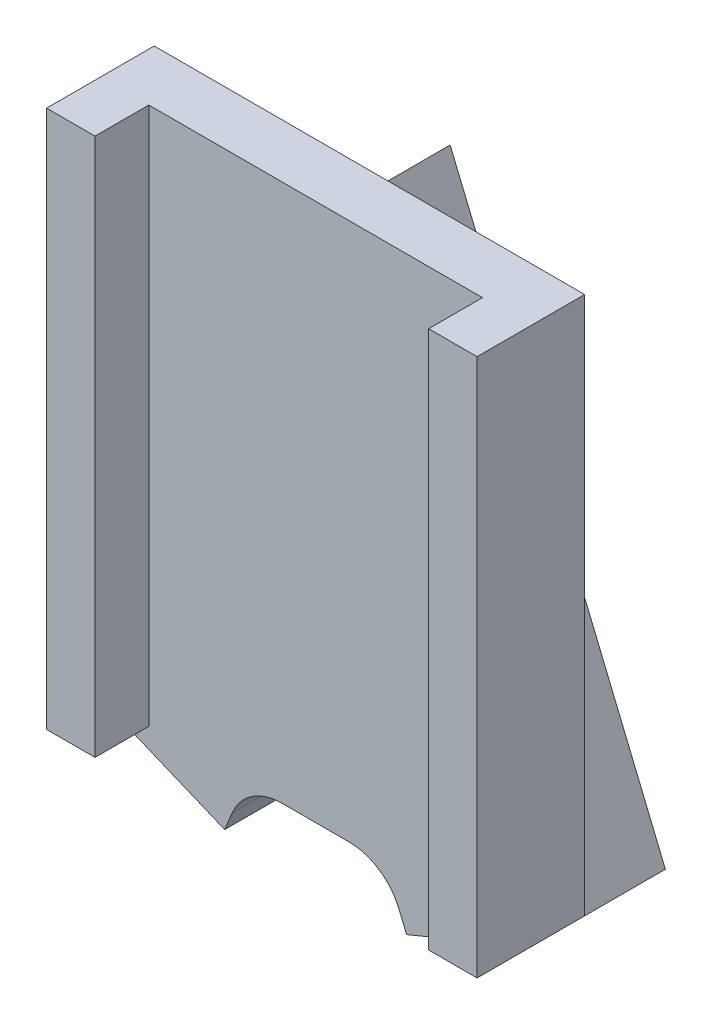
ISO-10303-21;
HEADER;
FILE_DESCRIPTION(('STEP AP214'),'2;1');
FILE_NAME('part.step','',(''),(''),'','','');
FILE_SCHEMA(('AUTOMOTIVE_DESIGN { 1 0 10303 214 1 1 1 1 }'));
ENDSEC;
DATA;
#1=APPLICATION_CONTEXT('core data for automotive mechanical design processes');
#2=APPLICATION_PROTOCOL_DEFINITION('international standard','automotive_design',2000,#1);
#3=PRODUCT_CONTEXT('',#1,'mechanical');
#4=PRODUCT('Part','Part','',(#3));
#5=PRODUCT_RELATED_PRODUCT_CATEGORY('part','',(#4));
#6=PRODUCT_DEFINITION_FORMATION('','',#4);
#7=PRODUCT_DEFINITION_CONTEXT('part definition',#1,'design');
#8=PRODUCT_DEFINITION('design','',#6,#7);
#9=PRODUCT_DEFINITION_SHAPE('','',#8);
#10=(LENGTH_UNIT() NAMED_UNIT(*) SI_UNIT(.MILLI.,.METRE.));
#11=(NAMED_UNIT(*) PLANE_ANGLE_UNIT() SI_UNIT($,.RADIAN.));
#12=(NAMED_UNIT(*) SI_UNIT($,.STERADIAN.) SOLID_ANGLE_UNIT());
#13=UNCERTAINTY_MEASURE_WITH_UNIT(LENGTH_MEASURE(1.E-05),#10,'distance_accuracy_value','');
#14=(GEOMETRIC_REPRESENTATION_CONTEXT(3) GLOBAL_UNCERTAINTY_ASSIGNED_CONTEXT((#13)) GLOBAL_UNIT_ASSIGNED_CONTEXT((#10,
#11,#12)) REPRESENTATION_CONTEXT('',''));
#15=CARTESIAN_POINT('',(0.,0.,0.));
#16=DIRECTION('',(0.,0.,1.));
#17=DIRECTION('',(1.,0.,0.));
#18=AXIS2_PLACEMENT_3D('',#15,#16,#17);
#19=CARTESIAN_POINT('',(2.30969883127822,-10.9567085809127,1.));
#20=DIRECTION('',(0.923879532511288,-0.382683432365087,0.));
#21=DIRECTION('',(0.382683432365087,0.923879532511288,0.));
#22=AXIS2_PLACEMENT_3D('',#19,#20,#21);
#23=PLANE('',#22);
#24=DIRECTION('',(0.382683432365087,0.923879532511288,0.));
#25=VECTOR('',#24,1.);
#26=CARTESIAN_POINT('',(5.84523273721094,-2.42117467497996,0.));
#27=LINE('',#26,#25);
#28=CARTESIAN_POINT('',(2.450279606139,-10.6173165676349,0.));
#29=VERTEX_POINT('',#28);
#30=CARTESIAN_POINT('',(3.71016818448233,-7.57567647471944,0.));
#31=VERTEX_POINT('',#30);
#32=EDGE_CURVE('E207',#29,#31,#27,.T.);
#33=ORIENTED_EDGE('',*,*,#32,.F.);
#34=DIRECTION('',(0.,0.,-1.));
#35=VECTOR('',#34,1.);
#36=CARTESIAN_POINT('',(2.450279606139,-10.6173165676349,1.));
#37=LINE('',#36,#35);
#38=CARTESIAN_POINT('',(2.450279606139,-10.6173165676349,1.));
#39=VERTEX_POINT('',#38);
#40=EDGE_CURVE('E296',#29,#39,#37,.F.);
#41=ORIENTED_EDGE('',*,*,#40,.T.);
#42=DIRECTION('',(-0.382683432365087,-0.923879532511288,0.));
#43=VECTOR('',#42,1.);
#44=CARTESIAN_POINT('',(2.30969883127822,-10.9567085809127,1.));
#45=LINE('',#44,#43);
#46=CARTESIAN_POINT('',(2.30969883127822,-10.9567085809127,1.));
#47=VERTEX_POINT('',#46);
#48=EDGE_CURVE('E308',#39,#47,#45,.T.);
#49=ORIENTED_EDGE('',*,*,#48,.T.);
#50=DIRECTION('',(0.,0.,-1.));
#51=VECTOR('',#50,1.);
#52=CARTESIAN_POINT('',(2.30969883127822,-10.9567085809127,1.));
#53=LINE('',#52,#51);
#54=CARTESIAN_POINT('',(2.30969883127822,-10.9567085809127,-1.5));
#55=VERTEX_POINT('',#54);
#56=EDGE_CURVE('E348',#47,#55,#53,.T.);
#57=ORIENTED_EDGE('',*,*,#56,.T.);
#58=DIRECTION('',(-0.382683432365087,-0.923879532511288,0.));
#59=VECTOR('',#58,1.);
#60=CARTESIAN_POINT('',(2.30969883127822,-10.9567085809127,-1.5));
#61=LINE('',#60,#59);
#62=CARTESIAN_POINT('',(3.71016818448233,-7.57567647471944,-1.5));
#63=VERTEX_POINT('',#62);
#64=EDGE_CURVE('E361',#63,#55,#61,.T.);
#65=ORIENTED_EDGE('',*,*,#64,.F.);
#66=DIRECTION('',(0.,0.,-1.));
#67=VECTOR('',#66,1.);
#68=CARTESIAN_POINT('',(3.71016818448233,-7.57567647471944,0.));
#69=LINE('',#68,#67);
#70=EDGE_CURVE('E198',#31,#63,#69,.T.);
#71=ORIENTED_EDGE('',*,*,#70,.F.);
#72=EDGE_LOOP('',(#33,#41,#49,#57,#65,#71));
#73=FACE_BOUND('',#72,.T.);
#74=ADVANCED_FACE('F33',(#73),#23,.T.);
#75=CARTESIAN_POINT('',(3.99999999999999,-6.8759605748895,1.));
#76=DIRECTION('',(-0.923879532511288,-0.382683432365088,0.));
#77=DIRECTION('',(0.382683432365088,-0.923879532511288,0.));
#78=AXIS2_PLACEMENT_3D('',#75,#76,#77);
#79=PLANE('',#78);
#80=DIRECTION('',(0.,0.,-1.));
#81=VECTOR('',#80,1.);
#82=CARTESIAN_POINT('',(4.01000933746841,-6.90012525315614,0.));
#83=LINE('',#82,#81);
#84=CARTESIAN_POINT('',(4.01000933746841,-6.90012525315614,0.));
#85=VERTEX_POINT('',#84);
#86=CARTESIAN_POINT('',(4.01000933746841,-6.90012525315614,-1.5));
#87=VERTEX_POINT('',#86);
#88=EDGE_CURVE('E199',#85,#87,#83,.T.);
#89=ORIENTED_EDGE('',*,*,#88,.F.);
#90=DIRECTION('',(0.382683432365088,-0.923879532511288,0.));
#91=VECTOR('',#90,1.);
#92=CARTESIAN_POINT('',(0.983194387535245,0.407252449766205,0.));
#93=LINE('',#92,#91);
#94=CARTESIAN_POINT('',(3.99999999999999,-6.8759605748895,0.));
#95=VERTEX_POINT('',#94);
#96=EDGE_CURVE('E214',#95,#85,#93,.T.);
#97=ORIENTED_EDGE('',*,*,#96,.F.);
#98=DIRECTION('',(0.,0.,-1.));
#99=VECTOR('',#98,1.);
#100=CARTESIAN_POINT('',(3.99999999999999,-6.8759605748895,1.));
#101=LINE('',#100,#99);
#102=CARTESIAN_POINT('',(3.99999999999999,-6.8759605748895,-1.5));
#103=VERTEX_POINT('',#102);
#104=EDGE_CURVE('E213',#95,#103,#101,.T.);
#105=ORIENTED_EDGE('',*,*,#104,.T.);
#106=DIRECTION('',(-0.382683432365088,0.923879532511288,0.));
#107=VECTOR('',#106,1.);
#108=CARTESIAN_POINT('',(3.99999999999999,-6.8759605748895,-1.5));
#109=LINE('',#108,#107);
#110=EDGE_CURVE('E362',#87,#103,#109,.T.);
#111=ORIENTED_EDGE('',*,*,#110,.F.);
#112=EDGE_LOOP('',(#89,#97,#105,#111));
#113=FACE_BOUND('',#112,.T.);
#114=ADVANCED_FACE('F437',(#113),#79,.T.);
#115=CARTESIAN_POINT('',(0.,-10.,2.));
#116=DIRECTION('',(0.,1.,0.));
#117=DIRECTION('',(0.,0.,1.));
#118=AXIS2_PLACEMENT_3D('',#115,#116,#117);
#119=PLANE('',#118);
#120=DIRECTION('',(1.,0.,0.));
#121=VECTOR('',#120,1.);
#122=CARTESIAN_POINT('',(0.900000000000001,-10.,1.));
#123=LINE('',#122,#121);
#124=CARTESIAN_POINT('',(3.37415913865028,-10.,1.));
#125=VERTEX_POINT('',#124);
#126=CARTESIAN_POINT('',(4.6258408613497,-10.,1.));
#127=VERTEX_POINT('',#126);
#128=EDGE_CURVE('E231',#125,#127,#123,.T.);
#129=ORIENTED_EDGE('',*,*,#128,.F.);
#130=DIRECTION('',(0.,0.,-1.));
#131=VECTOR('',#130,1.);
#132=CARTESIAN_POINT('',(3.37415913865028,-10.,2.));
#133=LINE('',#132,#131);
#134=CARTESIAN_POINT('',(3.37415913865028,-10.,0.));
#135=VERTEX_POINT('',#134);
#136=EDGE_CURVE('E293',#125,#135,#133,.T.);
#137=ORIENTED_EDGE('',*,*,#136,.T.);
#138=DIRECTION('',(1.,0.,0.));
#139=VECTOR('',#138,1.);
#140=CARTESIAN_POINT('',(0.,-10.,0.));
#141=LINE('',#140,#139);
#142=CARTESIAN_POINT('',(4.6258408613497,-10.,0.));
#143=VERTEX_POINT('',#142);
#144=EDGE_CURVE('E270',#135,#143,#141,.T.);
#145=ORIENTED_EDGE('',*,*,#144,.T.);
#146=DIRECTION('',(0.,0.,1.));
#147=VECTOR('',#146,1.);
#148=CARTESIAN_POINT('',(4.6258408613497,-10.,2.));
#149=LINE('',#148,#147);
#150=EDGE_CURVE('E290',#143,#127,#149,.T.);
#151=ORIENTED_EDGE('',*,*,#150,.T.);
#152=EDGE_LOOP('',(#129,#137,#145,#151));
#153=FACE_BOUND('',#152,.T.);
#154=ADVANCED_FACE('F313',(#153),#119,.F.);
#155=DIRECTION('',(0.,0.,-1.));
#156=VECTOR('',#155,1.);
#157=CARTESIAN_POINT('',(0.,-10.,2.));
#158=LINE('',#157,#156);
#159=CARTESIAN_POINT('',(0.,-10.,2.));
#160=VERTEX_POINT('',#159);
#161=CARTESIAN_POINT('',(0.,-10.,1.));
#162=VERTEX_POINT('',#161);
#163=EDGE_CURVE('E284',#160,#162,#158,.T.);
#164=ORIENTED_EDGE('',*,*,#163,.T.);
#165=DIRECTION('',(1.,0.,0.));
#166=VECTOR('',#165,1.);
#167=CARTESIAN_POINT('',(0.,-10.,1.));
#168=LINE('',#167,#166);
#169=CARTESIAN_POINT('',(0.900000000000001,-10.,1.));
#170=VERTEX_POINT('',#169);
#171=EDGE_CURVE('E228',#162,#170,#168,.T.);
#172=ORIENTED_EDGE('',*,*,#171,.T.);
#173=DIRECTION('',(0.,0.,1.));
#174=VECTOR('',#173,1.);
#175=CARTESIAN_POINT('',(0.900000000000001,-10.,1.));
#176=LINE('',#175,#174);
#177=CARTESIAN_POINT('',(0.900000000000001,-10.,2.));
#178=VERTEX_POINT('',#177);
#179=EDGE_CURVE('E239',#170,#178,#176,.T.);
#180=ORIENTED_EDGE('',*,*,#179,.T.);
#181=DIRECTION('',(1.,0.,0.));
#182=VECTOR('',#181,1.);
#183=CARTESIAN_POINT('',(0.,-10.,2.));
#184=LINE('',#183,#182);
#185=EDGE_CURVE('E258',#160,#178,#184,.T.);
#186=ORIENTED_EDGE('',*,*,#185,.F.);
#187=EDGE_LOOP('',(#164,#172,#180,#186));
#188=FACE_BOUND('',#187,.T.);
#189=ADVANCED_FACE('F429',(#188),#119,.F.);
#190=CARTESIAN_POINT('',(0.,0.,0.));
#191=DIRECTION('',(0.,0.,1.));
#192=DIRECTION('',(1.,0.,0.));
#193=AXIS2_PLACEMENT_3D('',#190,#191,#192);
#194=PLANE('',#193);
#195=DIRECTION('',(0.,1.,0.));
#196=VECTOR('',#195,1.);
#197=CARTESIAN_POINT('',(7.99999999999998,0.,0.));
#198=LINE('',#197,#196);
#199=CARTESIAN_POINT('',(7.99999999999998,-10.,0.));
#200=VERTEX_POINT('',#199);
#201=CARTESIAN_POINT('',(7.99999999999998,0.,0.));
#202=VERTEX_POINT('',#201);
#203=EDGE_CURVE('E273',#200,#202,#198,.T.);
#204=ORIENTED_EDGE('',*,*,#203,.F.);
#205=DIRECTION('',(-0.382683432365088,0.923879532511288,0.));
#206=VECTOR('',#205,1.);
#207=CARTESIAN_POINT('',(3.29289321881346,1.36396103067892,0.));
#208=LINE('',#207,#206);
#209=CARTESIAN_POINT('',(3.99999999999999,-0.343145750507577,0.));
#210=VERTEX_POINT('',#209);
#211=EDGE_CURVE('E222',#200,#210,#208,.T.);
#212=ORIENTED_EDGE('',*,*,#211,.T.);
#213=DIRECTION('',(-0.382683432365087,-0.923879532511288,0.));
#214=VECTOR('',#213,1.);
#215=CARTESIAN_POINT('',(3.53553390593272,-1.46446609406724,0.));
#216=LINE('',#215,#214);
#217=CARTESIAN_POINT('',(0.,-10.,0.));
#218=VERTEX_POINT('',#217);
#219=EDGE_CURVE('E216',#210,#218,#216,.T.);
#220=ORIENTED_EDGE('',*,*,#219,.T.);
#221=DIRECTION('',(0.,-1.,0.));
#222=VECTOR('',#221,1.);
#223=CARTESIAN_POINT('',(0.,0.,0.));
#224=LINE('',#223,#222);
#225=CARTESIAN_POINT('',(0.,0.,0.));
#226=VERTEX_POINT('',#225);
#227=EDGE_CURVE('E245',#226,#218,#224,.T.);
#228=ORIENTED_EDGE('',*,*,#227,.F.);
#229=DIRECTION('',(-1.,0.,0.));
#230=VECTOR('',#229,1.);
#231=CARTESIAN_POINT('',(0.,0.,0.));
#232=LINE('',#231,#230);
#233=EDGE_CURVE('E257',#202,#226,#232,.T.);
#234=ORIENTED_EDGE('',*,*,#233,.F.);
#235=EDGE_LOOP('',(#204,#212,#220,#228,#234));
#236=FACE_BOUND('',#235,.T.);
#237=ADVANCED_FACE('F395',(#236),#194,.F.);
#238=CARTESIAN_POINT('',(0.,0.,2.));
#239=DIRECTION('',(0.,0.,1.));
#240=DIRECTION('',(1.,0.,0.));
#241=AXIS2_PLACEMENT_3D('',#238,#239,#240);
#242=PLANE('',#241);
#243=DIRECTION('',(0.,-1.,0.));
#244=VECTOR('',#243,1.);
#245=CARTESIAN_POINT('',(0.9,0.,2.));
#246=LINE('',#245,#244);
#247=CARTESIAN_POINT('',(0.9,0.,2.));
#248=VERTEX_POINT('',#247);
#249=EDGE_CURVE('E240',#248,#178,#246,.T.);
#250=ORIENTED_EDGE('',*,*,#249,.F.);
#251=DIRECTION('',(-1.,0.,0.));
#252=VECTOR('',#251,1.);
#253=CARTESIAN_POINT('',(0.,0.,2.));
#254=LINE('',#253,#252);
#255=CARTESIAN_POINT('',(0.,0.,2.));
#256=VERTEX_POINT('',#255);
#257=EDGE_CURVE('E263',#248,#256,#254,.T.);
#258=ORIENTED_EDGE('',*,*,#257,.T.);
#259=DIRECTION('',(0.,-1.,0.));
#260=VECTOR('',#259,1.);
#261=CARTESIAN_POINT('',(0.,0.,2.));
#262=LINE('',#261,#260);
#263=EDGE_CURVE('E253',#256,#160,#262,.T.);
#264=ORIENTED_EDGE('',*,*,#263,.T.);
#265=ORIENTED_EDGE('',*,*,#185,.T.);
#266=EDGE_LOOP('',(#250,#258,#264,#265));
#267=FACE_BOUND('',#266,.T.);
#268=ADVANCED_FACE('F409',(#267),#242,.T.);
#269=CARTESIAN_POINT('',(0.,0.,2.));
#270=DIRECTION('',(1.,0.,0.));
#271=DIRECTION('',(0.,1.,0.));
#272=AXIS2_PLACEMENT_3D('',#269,#270,#271);
#273=PLANE('',#272);
#274=ORIENTED_EDGE('',*,*,#227,.T.);
#275=DIRECTION('',(0.,0.,-1.));
#276=VECTOR('',#275,1.);
#277=CARTESIAN_POINT('',(0.,-10.,1.));
#278=LINE('',#277,#276);
#279=EDGE_CURVE('E344',#162,#218,#278,.T.);
#280=ORIENTED_EDGE('',*,*,#279,.F.);
#281=ORIENTED_EDGE('',*,*,#163,.F.);
#282=ORIENTED_EDGE('',*,*,#263,.F.);
#283=DIRECTION('',(0.,0.,-1.));
#284=VECTOR('',#283,1.);
#285=CARTESIAN_POINT('',(0.,0.,2.));
#286=LINE('',#285,#284);
#287=EDGE_CURVE('E267',#256,#226,#286,.T.);
#288=ORIENTED_EDGE('',*,*,#287,.T.);
#289=EDGE_LOOP('',(#274,#280,#281,#282,#288));
#290=FACE_BOUND('',#289,.T.);
#291=ADVANCED_FACE('F404',(#290),#273,.F.);
#292=DIRECTION('',(0.,0.,1.));
#293=VECTOR('',#292,1.);
#294=CARTESIAN_POINT('',(7.09999999999998,-10.,1.));
#295=LINE('',#294,#293);
#296=CARTESIAN_POINT('',(7.09999999999998,-10.,1.));
#297=VERTEX_POINT('',#296);
#298=CARTESIAN_POINT('',(7.09999999999998,-10.,2.));
#299=VERTEX_POINT('',#298);
#300=EDGE_CURVE('E249',#297,#299,#295,.T.);
#301=ORIENTED_EDGE('',*,*,#300,.F.);
#302=CARTESIAN_POINT('',(7.99999999999998,-10.,1.));
#303=VERTEX_POINT('',#302);
#304=EDGE_CURVE('E225',#297,#303,#168,.T.);
#305=ORIENTED_EDGE('',*,*,#304,.T.);
#306=DIRECTION('',(0.,0.,-1.));
#307=VECTOR('',#306,1.);
#308=CARTESIAN_POINT('',(7.99999999999998,-10.,2.));
#309=LINE('',#308,#307);
#310=CARTESIAN_POINT('',(7.99999999999998,-10.,2.));
#311=VERTEX_POINT('',#310);
#312=EDGE_CURVE('E281',#311,#303,#309,.T.);
#313=ORIENTED_EDGE('',*,*,#312,.F.);
#314=EDGE_CURVE('E256',#299,#311,#184,.T.);
#315=ORIENTED_EDGE('',*,*,#314,.F.);
#316=EDGE_LOOP('',(#301,#305,#313,#315));
#317=FACE_BOUND('',#316,.T.);
#318=ADVANCED_FACE('F426',(#317),#119,.F.);
#319=CARTESIAN_POINT('',(7.99999999999998,0.,2.));
#320=DIRECTION('',(-1.,0.,0.));
#321=DIRECTION('',(0.,-1.,0.));
#322=AXIS2_PLACEMENT_3D('',#319,#320,#321);
#323=PLANE('',#322);
#324=ORIENTED_EDGE('',*,*,#203,.T.);
#325=DIRECTION('',(0.,0.,-1.));
#326=VECTOR('',#325,1.);
#327=CARTESIAN_POINT('',(7.99999999999998,0.,2.));
#328=LINE('',#327,#326);
#329=CARTESIAN_POINT('',(7.99999999999998,0.,2.));
#330=VERTEX_POINT('',#329);
#331=EDGE_CURVE('E278',#330,#202,#328,.T.);
#332=ORIENTED_EDGE('',*,*,#331,.F.);
#333=DIRECTION('',(0.,1.,0.));
#334=VECTOR('',#333,1.);
#335=CARTESIAN_POINT('',(7.99999999999998,0.,2.));
#336=LINE('',#335,#334);
#337=EDGE_CURVE('E261',#311,#330,#336,.T.);
#338=ORIENTED_EDGE('',*,*,#337,.F.);
#339=ORIENTED_EDGE('',*,*,#312,.T.);
#340=DIRECTION('',(0.,0.,-1.));
#341=VECTOR('',#340,1.);
#342=CARTESIAN_POINT('',(7.99999999999998,-10.,1.));
#343=LINE('',#342,#341);
#344=EDGE_CURVE('E338',#303,#200,#343,.T.);
#345=ORIENTED_EDGE('',*,*,#344,.T.);
#346=EDGE_LOOP('',(#324,#332,#338,#339,#345));
#347=FACE_BOUND('',#346,.T.);
#348=ADVANCED_FACE('F389',(#347),#323,.F.);
#349=CARTESIAN_POINT('',(0.,0.,2.));
#350=DIRECTION('',(0.,-1.,0.));
#351=DIRECTION('',(0.,0.,-1.));
#352=AXIS2_PLACEMENT_3D('',#349,#350,#351);
#353=PLANE('',#352);
#354=ORIENTED_EDGE('',*,*,#257,.F.);
#355=DIRECTION('',(0.,0.,1.));
#356=VECTOR('',#355,1.);
#357=CARTESIAN_POINT('',(0.9,0.,1.));
#358=LINE('',#357,#356);
#359=CARTESIAN_POINT('',(0.9,0.,1.));
#360=VERTEX_POINT('',#359);
#361=EDGE_CURVE('E243',#360,#248,#358,.T.);
#362=ORIENTED_EDGE('',*,*,#361,.F.);
#363=DIRECTION('',(-1.,0.,0.));
#364=VECTOR('',#363,1.);
#365=CARTESIAN_POINT('',(0.9,0.,1.));
#366=LINE('',#365,#364);
#367=CARTESIAN_POINT('',(7.09999999999998,0.,1.));
#368=VERTEX_POINT('',#367);
#369=EDGE_CURVE('E236',#368,#360,#366,.T.);
#370=ORIENTED_EDGE('',*,*,#369,.F.);
#371=DIRECTION('',(0.,0.,1.));
#372=VECTOR('',#371,1.);
#373=CARTESIAN_POINT('',(7.09999999999998,0.,1.));
#374=LINE('',#373,#372);
#375=CARTESIAN_POINT('',(7.09999999999998,0.,2.));
#376=VERTEX_POINT('',#375);
#377=EDGE_CURVE('E246',#368,#376,#374,.T.);
#378=ORIENTED_EDGE('',*,*,#377,.T.);
#379=EDGE_CURVE('E264',#330,#376,#254,.T.);
#380=ORIENTED_EDGE('',*,*,#379,.F.);
#381=ORIENTED_EDGE('',*,*,#331,.T.);
#382=ORIENTED_EDGE('',*,*,#233,.T.);
#383=ORIENTED_EDGE('',*,*,#287,.F.);
#384=EDGE_LOOP('',(#354,#362,#370,#378,#380,#381,#382,#383));
#385=FACE_BOUND('',#384,.T.);
#386=ADVANCED_FACE('F400',(#385),#353,.F.);
#387=DIRECTION('',(0.,1.,0.));
#388=VECTOR('',#387,1.);
#389=CARTESIAN_POINT('',(7.09999999999998,0.,2.));
#390=LINE('',#389,#388);
#391=EDGE_CURVE('E232',#299,#376,#390,.T.);
#392=ORIENTED_EDGE('',*,*,#391,.F.);
#393=ORIENTED_EDGE('',*,*,#314,.T.);
#394=ORIENTED_EDGE('',*,*,#337,.T.);
#395=ORIENTED_EDGE('',*,*,#379,.T.);
#396=EDGE_LOOP('',(#392,#393,#394,#395));
#397=FACE_BOUND('',#396,.T.);
#398=ADVANCED_FACE('F423',(#397),#242,.T.);
#399=ORIENTED_EDGE('',*,*,#32,.T.);
#400=CARTESIAN_POINT('',(3.99999999999999,-7.3,0.));
#401=DIRECTION('',(0.,0.,-1.));
#402=DIRECTION('',(-1.,0.,0.));
#403=AXIS2_PLACEMENT_3D('',#400,#401,#402);
#404=CIRCLE('',#403,0.4);
#405=CARTESIAN_POINT('',(3.98999066253156,-6.90012525315614,0.));
#406=VERTEX_POINT('',#405);
#407=EDGE_CURVE('E190',#31,#406,#404,.T.);
#408=ORIENTED_EDGE('',*,*,#407,.T.);
#409=EDGE_CURVE('E204',#406,#95,#27,.T.);
#410=ORIENTED_EDGE('',*,*,#409,.T.);
#411=ORIENTED_EDGE('',*,*,#96,.T.);
#412=CARTESIAN_POINT('',(4.28983181551765,-7.57567647471944,0.));
#413=VERTEX_POINT('',#412);
#414=EDGE_CURVE('E208',#85,#413,#404,.T.);
#415=ORIENTED_EDGE('',*,*,#414,.T.);
#416=CARTESIAN_POINT('',(5.54972039386099,-10.6173165676349,0.));
#417=VERTEX_POINT('',#416);
#418=EDGE_CURVE('E47',#413,#417,#93,.T.);
#419=ORIENTED_EDGE('',*,*,#418,.T.);
#420=CARTESIAN_POINT('',(4.6258408613497,-11.,0.));
#421=DIRECTION('',(0.,0.,1.));
#422=DIRECTION('',(1.,0.,0.));
#423=AXIS2_PLACEMENT_3D('',#420,#421,#422);
#424=CIRCLE('',#423,1.);
#425=EDGE_CURVE('E11',#417,#143,#424,.T.);
#426=ORIENTED_EDGE('',*,*,#425,.T.);
#427=ORIENTED_EDGE('',*,*,#144,.F.);
#428=CARTESIAN_POINT('',(3.37415913865028,-11.,0.));
#429=DIRECTION('',(0.,0.,1.));
#430=DIRECTION('',(1.,0.,0.));
#431=AXIS2_PLACEMENT_3D('',#428,#429,#430);
#432=CIRCLE('',#431,1.);
#433=EDGE_CURVE('E300',#135,#29,#432,.T.);
#434=ORIENTED_EDGE('',*,*,#433,.T.);
#435=EDGE_LOOP('',(#399,#408,#410,#411,#415,#419,#426,#427,#434));
#436=FACE_BOUND('',#435,.T.);
#437=ADVANCED_FACE('F202',(#436),#194,.F.);
#438=CARTESIAN_POINT('',(0.9,0.,1.));
#439=DIRECTION('',(-1.,0.,0.));
#440=DIRECTION('',(0.,-1.,0.));
#441=AXIS2_PLACEMENT_3D('',#438,#439,#440);
#442=PLANE('',#441);
#443=ORIENTED_EDGE('',*,*,#249,.T.);
#444=ORIENTED_EDGE('',*,*,#179,.F.);
#445=DIRECTION('',(0.,-1.,0.));
#446=VECTOR('',#445,1.);
#447=CARTESIAN_POINT('',(0.9,0.,1.));
#448=LINE('',#447,#446);
#449=EDGE_CURVE('E229',#360,#170,#448,.T.);
#450=ORIENTED_EDGE('',*,*,#449,.F.);
#451=ORIENTED_EDGE('',*,*,#361,.T.);
#452=EDGE_LOOP('',(#443,#444,#450,#451));
#453=FACE_BOUND('',#452,.T.);
#454=ADVANCED_FACE('F413',(#453),#442,.F.);
#455=CARTESIAN_POINT('',(7.09999999999998,0.,1.));
#456=DIRECTION('',(1.,0.,0.));
#457=DIRECTION('',(0.,1.,0.));
#458=AXIS2_PLACEMENT_3D('',#455,#456,#457);
#459=PLANE('',#458);
#460=ORIENTED_EDGE('',*,*,#391,.T.);
#461=ORIENTED_EDGE('',*,*,#377,.F.);
#462=DIRECTION('',(0.,1.,0.));
#463=VECTOR('',#462,1.);
#464=CARTESIAN_POINT('',(7.09999999999998,0.,1.));
#465=LINE('',#464,#463);
#466=EDGE_CURVE('E234',#297,#368,#465,.T.);
#467=ORIENTED_EDGE('',*,*,#466,.F.);
#468=ORIENTED_EDGE('',*,*,#300,.T.);
#469=EDGE_LOOP('',(#460,#461,#467,#468));
#470=FACE_BOUND('',#469,.T.);
#471=ADVANCED_FACE('F420',(#470),#459,.F.);
#472=CARTESIAN_POINT('',(0.,0.,1.));
#473=DIRECTION('',(0.,0.,1.));
#474=DIRECTION('',(1.,0.,0.));
#475=AXIS2_PLACEMENT_3D('',#472,#473,#474);
#476=PLANE('',#475);
#477=ORIENTED_EDGE('',*,*,#449,.T.);
#478=ORIENTED_EDGE('',*,*,#171,.F.);
#479=DIRECTION('',(-0.923879532511288,0.382683432365087,0.));
#480=VECTOR('',#479,1.);
#481=CARTESIAN_POINT('',(0.,-10.,1.));
#482=LINE('',#481,#480);
#483=EDGE_CURVE('E330',#47,#162,#482,.T.);
#484=ORIENTED_EDGE('',*,*,#483,.F.);
#485=ORIENTED_EDGE('',*,*,#48,.F.);
#486=CARTESIAN_POINT('',(3.37415913865028,-11.,1.));
#487=DIRECTION('',(0.,0.,1.));
#488=DIRECTION('',(1.,0.,0.));
#489=AXIS2_PLACEMENT_3D('',#486,#487,#488);
#490=CIRCLE('',#489,1.);
#491=EDGE_CURVE('E302',#39,#125,#490,.F.);
#492=ORIENTED_EDGE('',*,*,#491,.T.);
#493=ORIENTED_EDGE('',*,*,#128,.T.);
#494=CARTESIAN_POINT('',(4.6258408613497,-11.,1.));
#495=DIRECTION('',(0.,0.,1.));
#496=DIRECTION('',(1.,0.,0.));
#497=AXIS2_PLACEMENT_3D('',#494,#495,#496);
#498=CIRCLE('',#497,1.);
#499=CARTESIAN_POINT('',(5.54972039386099,-10.6173165676349,1.));
#500=VERTEX_POINT('',#499);
#501=EDGE_CURVE('E41',#127,#500,#498,.F.);
#502=ORIENTED_EDGE('',*,*,#501,.T.);
#503=DIRECTION('',(-0.382683432365088,0.923879532511288,0.));
#504=VECTOR('',#503,1.);
#505=CARTESIAN_POINT('',(3.99999999999999,-6.8759605748895,1.));
#506=LINE('',#505,#504);
#507=CARTESIAN_POINT('',(5.69030116872176,-10.9567085809127,1.));
#508=VERTEX_POINT('',#507);
#509=EDGE_CURVE('E323',#508,#500,#506,.T.);
#510=ORIENTED_EDGE('',*,*,#509,.F.);
#511=DIRECTION('',(-0.923879532511288,-0.382683432365088,0.));
#512=VECTOR('',#511,1.);
#513=CARTESIAN_POINT('',(7.99999999999998,-10.,1.));
#514=LINE('',#513,#512);
#515=EDGE_CURVE('E328',#303,#508,#514,.T.);
#516=ORIENTED_EDGE('',*,*,#515,.F.);
#517=ORIENTED_EDGE('',*,*,#304,.F.);
#518=ORIENTED_EDGE('',*,*,#466,.T.);
#519=ORIENTED_EDGE('',*,*,#369,.T.);
#520=EDGE_LOOP('',(#477,#478,#484,#485,#492,#493,#502,#510,#516,#517,#518,#519));
#521=FACE_BOUND('',#520,.T.);
#522=ADVANCED_FACE('F306',(#521),#476,.T.);
#523=CARTESIAN_POINT('',(7.99999999999998,-10.,1.));
#524=DIRECTION('',(0.923879532511288,0.382683432365088,0.));
#525=DIRECTION('',(-0.382683432365088,0.923879532511288,0.));
#526=AXIS2_PLACEMENT_3D('',#523,#524,#525);
#527=PLANE('',#526);
#528=ORIENTED_EDGE('',*,*,#211,.F.);
#529=CARTESIAN_POINT('',(7.99999999999998,-10.,-1.5));
#530=VERTEX_POINT('',#529);
#531=EDGE_CURVE('E341',#200,#530,#343,.T.);
#532=ORIENTED_EDGE('',*,*,#531,.T.);
#533=DIRECTION('',(0.382683432365088,-0.923879532511288,0.));
#534=VECTOR('',#533,1.);
#535=CARTESIAN_POINT('',(7.99999999999998,-10.,-1.5));
#536=LINE('',#535,#534);
#537=CARTESIAN_POINT('',(3.99999999999999,-0.343145750507577,-1.5));
#538=VERTEX_POINT('',#537);
#539=EDGE_CURVE('E332',#538,#530,#536,.T.);
#540=ORIENTED_EDGE('',*,*,#539,.F.);
#541=DIRECTION('',(0.,0.,-1.));
#542=VECTOR('',#541,1.);
#543=CARTESIAN_POINT('',(3.99999999999999,-0.343145750507577,1.));
#544=LINE('',#543,#542);
#545=EDGE_CURVE('E342',#210,#538,#544,.T.);
#546=ORIENTED_EDGE('',*,*,#545,.F.);
#547=EDGE_LOOP('',(#528,#532,#540,#546));
#548=FACE_BOUND('',#547,.T.);
#549=ADVANCED_FACE('F386',(#548),#527,.T.);
#550=CARTESIAN_POINT('',(0.,-10.,1.));
#551=DIRECTION('',(-0.923879532511288,0.382683432365087,0.));
#552=DIRECTION('',(-0.382683432365087,-0.923879532511288,0.));
#553=AXIS2_PLACEMENT_3D('',#550,#551,#552);
#554=PLANE('',#553);
#555=ORIENTED_EDGE('',*,*,#219,.F.);
#556=ORIENTED_EDGE('',*,*,#545,.T.);
#557=DIRECTION('',(0.382683432365087,0.923879532511288,0.));
#558=VECTOR('',#557,1.);
#559=CARTESIAN_POINT('',(0.,-10.,-1.5));
#560=LINE('',#559,#558);
#561=CARTESIAN_POINT('',(0.,-10.,-1.5));
#562=VERTEX_POINT('',#561);
#563=EDGE_CURVE('E380',#562,#538,#560,.T.);
#564=ORIENTED_EDGE('',*,*,#563,.F.);
#565=EDGE_CURVE('E347',#218,#562,#278,.T.);
#566=ORIENTED_EDGE('',*,*,#565,.F.);
#567=EDGE_LOOP('',(#555,#556,#564,#566));
#568=FACE_BOUND('',#567,.T.);
#569=ADVANCED_FACE('F450',(#568),#554,.T.);
#570=DIRECTION('',(0.,0.,-1.));
#571=VECTOR('',#570,1.);
#572=CARTESIAN_POINT('',(3.98999066253156,-6.90012525315614,0.));
#573=LINE('',#572,#571);
#574=CARTESIAN_POINT('',(3.98999066253156,-6.90012525315614,-1.5));
#575=VERTEX_POINT('',#574);
#576=EDGE_CURVE('E187',#575,#406,#573,.F.);
#577=ORIENTED_EDGE('',*,*,#576,.F.);
#578=EDGE_CURVE('E375',#103,#575,#61,.T.);
#579=ORIENTED_EDGE('',*,*,#578,.F.);
#580=ORIENTED_EDGE('',*,*,#104,.F.);
#581=ORIENTED_EDGE('',*,*,#409,.F.);
#582=EDGE_LOOP('',(#577,#579,#580,#581));
#583=FACE_BOUND('',#582,.T.);
#584=ADVANCED_FACE('F211',(#583),#23,.T.);
#585=ORIENTED_EDGE('',*,*,#509,.T.);
#586=DIRECTION('',(0.,0.,1.));
#587=VECTOR('',#586,1.);
#588=CARTESIAN_POINT('',(5.54972039386099,-10.6173165676349,1.));
#589=LINE('',#588,#587);
#590=EDGE_CURVE('E298',#500,#417,#589,.F.);
#591=ORIENTED_EDGE('',*,*,#590,.T.);
#592=ORIENTED_EDGE('',*,*,#418,.F.);
#593=DIRECTION('',(0.,0.,-1.));
#594=VECTOR('',#593,1.);
#595=CARTESIAN_POINT('',(4.28983181551765,-7.57567647471944,0.));
#596=LINE('',#595,#594);
#597=CARTESIAN_POINT('',(4.28983181551765,-7.57567647471944,-1.5));
#598=VERTEX_POINT('',#597);
#599=EDGE_CURVE('E359',#598,#413,#596,.F.);
#600=ORIENTED_EDGE('',*,*,#599,.F.);
#601=CARTESIAN_POINT('',(5.69030116872176,-10.9567085809127,-1.5));
#602=VERTEX_POINT('',#601);
#603=EDGE_CURVE('E358',#602,#598,#109,.T.);
#604=ORIENTED_EDGE('',*,*,#603,.F.);
#605=DIRECTION('',(0.,0.,-1.));
#606=VECTOR('',#605,1.);
#607=CARTESIAN_POINT('',(5.69030116872176,-10.9567085809127,1.));
#608=LINE('',#607,#606);
#609=EDGE_CURVE('E325',#508,#602,#608,.T.);
#610=ORIENTED_EDGE('',*,*,#609,.F.);
#611=EDGE_LOOP('',(#585,#591,#592,#600,#604,#610));
#612=FACE_BOUND('',#611,.T.);
#613=ADVANCED_FACE('F321',(#612),#79,.T.);
#614=CARTESIAN_POINT('',(7.99999999999998,-10.,1.));
#615=DIRECTION('',(0.382683432365088,-0.923879532511288,0.));
#616=DIRECTION('',(0.923879532511288,0.382683432365088,0.));
#617=AXIS2_PLACEMENT_3D('',#614,#615,#616);
#618=PLANE('',#617);
#619=CARTESIAN_POINT('',(6.84515058436087,-10.4783542904564,-0.25));
#620=DIRECTION('',(0.382683432365088,-0.923879532511288,0.));
#621=DIRECTION('',(0.923879532511288,0.382683432365088,0.));
#622=AXIS2_PLACEMENT_3D('',#619,#620,#621);
#623=CIRCLE('',#622,0.499999999999999);
#624=CARTESIAN_POINT('',(7.30709035061652,-10.2870125742738,-0.25));
#625=VERTEX_POINT('',#624);
#626=EDGE_CURVE('E477',#625,#625,#623,.T.);
#627=ORIENTED_EDGE('',*,*,#626,.F.);
#628=EDGE_LOOP('',(#627));
#629=FACE_BOUND('',#628,.T.);
#630=ORIENTED_EDGE('',*,*,#609,.T.);
#631=DIRECTION('',(-0.923879532511288,-0.382683432365088,0.));
#632=VECTOR('',#631,1.);
#633=CARTESIAN_POINT('',(7.99999999999998,-10.,-1.5));
#634=LINE('',#633,#632);
#635=EDGE_CURVE('E356',#530,#602,#634,.T.);
#636=ORIENTED_EDGE('',*,*,#635,.F.);
#637=ORIENTED_EDGE('',*,*,#531,.F.);
#638=ORIENTED_EDGE('',*,*,#344,.F.);
#639=ORIENTED_EDGE('',*,*,#515,.T.);
#640=EDGE_LOOP('',(#630,#636,#637,#638,#639));
#641=FACE_BOUND('',#640,.T.);
#642=ADVANCED_FACE('F353',(#629,#641),#618,.T.);
#643=CARTESIAN_POINT('',(0.,-10.,1.));
#644=DIRECTION('',(-0.382683432365087,-0.923879532511288,0.));
#645=DIRECTION('',(0.923879532511288,-0.382683432365087,0.));
#646=AXIS2_PLACEMENT_3D('',#643,#644,#645);
#647=PLANE('',#646);
#648=CARTESIAN_POINT('',(1.19102862325458,-10.4933402089267,-0.25));
#649=DIRECTION('',(-0.382683432365087,-0.923879532511288,0.));
#650=DIRECTION('',(0.923879532511288,-0.382683432365087,0.));
#651=AXIS2_PLACEMENT_3D('',#648,#649,#650);
#652=CIRCLE('',#651,0.499999999999945);
#653=CARTESIAN_POINT('',(1.65296838951018,-10.6846819251093,-0.25));
#654=VERTEX_POINT('',#653);
#655=EDGE_CURVE('E474',#654,#654,#652,.T.);
#656=ORIENTED_EDGE('',*,*,#655,.F.);
#657=EDGE_LOOP('',(#656));
#658=FACE_BOUND('',#657,.T.);
#659=ORIENTED_EDGE('',*,*,#279,.T.);
#660=ORIENTED_EDGE('',*,*,#565,.T.);
#661=DIRECTION('',(-0.923879532511288,0.382683432365087,0.));
#662=VECTOR('',#661,1.);
#663=CARTESIAN_POINT('',(0.,-10.,-1.5));
#664=LINE('',#663,#662);
#665=EDGE_CURVE('E377',#55,#562,#664,.T.);
#666=ORIENTED_EDGE('',*,*,#665,.F.);
#667=ORIENTED_EDGE('',*,*,#56,.F.);
#668=ORIENTED_EDGE('',*,*,#483,.T.);
#669=EDGE_LOOP('',(#659,#660,#666,#667,#668));
#670=FACE_BOUND('',#669,.T.);
#671=ADVANCED_FACE('F461',(#658,#670),#647,.T.);
#672=CARTESIAN_POINT('',(0.,0.,-1.5));
#673=DIRECTION('',(0.,0.,1.));
#674=DIRECTION('',(1.,0.,0.));
#675=AXIS2_PLACEMENT_3D('',#672,#673,#674);
#676=PLANE('',#675);
#677=ORIENTED_EDGE('',*,*,#578,.T.);
#678=CARTESIAN_POINT('',(3.99999999999999,-7.3,-1.5));
#679=DIRECTION('',(0.,0.,1.));
#680=DIRECTION('',(1.,0.,0.));
#681=AXIS2_PLACEMENT_3D('',#678,#679,#680);
#682=CIRCLE('',#681,0.4);
#683=EDGE_CURVE('E193',#575,#63,#682,.T.);
#684=ORIENTED_EDGE('',*,*,#683,.T.);
#685=ORIENTED_EDGE('',*,*,#64,.T.);
#686=ORIENTED_EDGE('',*,*,#665,.T.);
#687=ORIENTED_EDGE('',*,*,#563,.T.);
#688=ORIENTED_EDGE('',*,*,#539,.T.);
#689=ORIENTED_EDGE('',*,*,#635,.T.);
#690=ORIENTED_EDGE('',*,*,#603,.T.);
#691=EDGE_CURVE('E287',#598,#87,#682,.T.);
#692=ORIENTED_EDGE('',*,*,#691,.T.);
#693=ORIENTED_EDGE('',*,*,#110,.T.);
#694=EDGE_LOOP('',(#677,#684,#685,#686,#687,#688,#689,#690,#692,#693));
#695=FACE_BOUND('',#694,.T.);
#696=ADVANCED_FACE('F365',(#695),#676,.F.);
#697=CARTESIAN_POINT('',(2.18600554740386,-8.09125342439728,-0.25));
#698=DIRECTION('',(-0.382683432365087,-0.923879532511288,0.));
#699=DIRECTION('',(0.923879532511288,-0.382683432365087,0.));
#700=AXIS2_PLACEMENT_3D('',#697,#698,#699);
#701=CONICAL_SURFACE('',#700,0.399999999999999,1.02974425867665);
#702=CARTESIAN_POINT('',(2.27798130902885,-7.86920429327263,-0.250000000000001));
#703=VERTEX_POINT('',#702);
#704=VERTEX_LOOP('',#703);
#705=FACE_BOUND('',#704,.T.);
#706=CARTESIAN_POINT('',(2.18600554740386,-8.09125342439728,-0.25));
#707=DIRECTION('',(-0.382683432365087,-0.923879532511288,0.));
#708=DIRECTION('',(0.923879532511288,-0.382683432365087,0.));
#709=AXIS2_PLACEMENT_3D('',#706,#707,#708);
#710=CIRCLE('',#709,0.399999999999999);
#711=CARTESIAN_POINT('',(2.55555736040837,-8.24432679734331,-0.25));
#712=VERTEX_POINT('',#711);
#713=EDGE_CURVE('E368',#712,#712,#710,.T.);
#714=ORIENTED_EDGE('',*,*,#713,.T.);
#715=EDGE_LOOP('',(#714));
#716=FACE_BOUND('',#715,.T.);
#717=ADVANCED_FACE('F468',(#705,#716),#701,.F.);
#718=CARTESIAN_POINT('',(1.19102862325463,-10.4933402089266,-0.25));
#719=DIRECTION('',(-0.382683432365087,-0.923879532511288,0.));
#720=DIRECTION('',(0.923879532511288,-0.382683432365087,0.));
#721=AXIS2_PLACEMENT_3D('',#718,#719,#720);
#722=CYLINDRICAL_SURFACE('',#721,0.399999999999999);
#723=ORIENTED_EDGE('',*,*,#713,.F.);
#724=EDGE_LOOP('',(#723));
#725=FACE_BOUND('',#724,.T.);
#726=CARTESIAN_POINT('',(1.95639548798481,-8.64558114390405,-0.25));
#727=DIRECTION('',(-0.382683432365087,-0.923879532511288,0.));
#728=DIRECTION('',(0.923879532511288,-0.382683432365087,0.));
#729=AXIS2_PLACEMENT_3D('',#726,#727,#728);
#730=CIRCLE('',#729,0.399999999999999);
#731=CARTESIAN_POINT('',(2.32594730098932,-8.79865451685009,-0.25));
#732=VERTEX_POINT('',#731);
#733=EDGE_CURVE('E371',#732,#732,#730,.T.);
#734=ORIENTED_EDGE('',*,*,#733,.T.);
#735=EDGE_LOOP('',(#734));
#736=FACE_BOUND('',#735,.T.);
#737=ADVANCED_FACE('F492',(#725,#736),#722,.F.);
#738=CARTESIAN_POINT('',(1.95639548798481,-8.64558114390405,0.149999999999999));
#739=DIRECTION('',(0.382683432365087,0.923879532511288,0.));
#740=DIRECTION('',(-0.923879532511288,0.382683432365087,0.));
#741=AXIS2_PLACEMENT_3D('',#738,#739,#740);
#742=PLANE('',#741);
#743=ORIENTED_EDGE('',*,*,#733,.F.);
#744=EDGE_LOOP('',(#743));
#745=FACE_BOUND('',#744,.T.);
#746=CARTESIAN_POINT('',(1.95639548798481,-8.64558114390405,-0.25));
#747=DIRECTION('',(-0.382683432365087,-0.923879532511288,0.));
#748=DIRECTION('',(0.923879532511288,-0.382683432365087,0.));
#749=AXIS2_PLACEMENT_3D('',#746,#747,#748);
#750=CIRCLE('',#749,0.499999999999996);
#751=CARTESIAN_POINT('',(2.41833525424045,-8.83692286008659,-0.25));
#752=VERTEX_POINT('',#751);
#753=EDGE_CURVE('E487',#752,#752,#750,.T.);
#754=ORIENTED_EDGE('',*,*,#753,.T.);
#755=EDGE_LOOP('',(#754));
#756=FACE_BOUND('',#755,.T.);
#757=ADVANCED_FACE('F494',(#745,#756),#742,.F.);
#758=CARTESIAN_POINT('',(1.19102862325463,-10.4933402089266,-0.25));
#759=DIRECTION('',(-0.382683432365087,-0.923879532511288,0.));
#760=DIRECTION('',(0.923879532511288,-0.382683432365087,0.));
#761=AXIS2_PLACEMENT_3D('',#758,#759,#760);
#762=CYLINDRICAL_SURFACE('',#761,0.49999999999997);
#763=ORIENTED_EDGE('',*,*,#753,.F.);
#764=EDGE_LOOP('',(#763));
#765=FACE_BOUND('',#764,.T.);
#766=ORIENTED_EDGE('',*,*,#655,.T.);
#767=EDGE_LOOP('',(#766));
#768=FACE_BOUND('',#767,.T.);
#769=ADVANCED_FACE('F497',(#765,#768),#762,.F.);
#770=CARTESIAN_POINT('',(4.93173342253543,-5.85895662789992,-0.25));
#771=DIRECTION('',(0.382683432365088,-0.923879532511288,0.));
#772=DIRECTION('',(0.923879532511288,0.382683432365088,0.));
#773=AXIS2_PLACEMENT_3D('',#770,#771,#772);
#774=CONICAL_SURFACE('',#773,0.499999999999999,1.02974425867665);
#775=CARTESIAN_POINT('',(4.81676372050419,-5.58139521399411,-0.250000000000001));
#776=VERTEX_POINT('',#775);
#777=VERTEX_LOOP('',#776);
#778=FACE_BOUND('',#777,.T.);
#779=CARTESIAN_POINT('',(4.93173342253543,-5.85895662789992,-0.25));
#780=DIRECTION('',(0.382683432365088,-0.923879532511288,0.));
#781=DIRECTION('',(0.923879532511288,0.382683432365088,0.));
#782=AXIS2_PLACEMENT_3D('',#779,#780,#781);
#783=CIRCLE('',#782,0.499999999999999);
#784=CARTESIAN_POINT('',(5.39367318879107,-5.66761491171738,-0.25));
#785=VERTEX_POINT('',#784);
#786=EDGE_CURVE('E480',#785,#785,#783,.T.);
#787=ORIENTED_EDGE('',*,*,#786,.T.);
#788=EDGE_LOOP('',(#787));
#789=FACE_BOUND('',#788,.T.);
#790=ADVANCED_FACE('F503',(#778,#789),#774,.F.);
#791=CARTESIAN_POINT('',(6.84515058436087,-10.4783542904564,-0.25));
#792=DIRECTION('',(0.382683432365088,-0.923879532511288,0.));
#793=DIRECTION('',(0.923879532511288,0.382683432365088,0.));
#794=AXIS2_PLACEMENT_3D('',#791,#792,#793);
#795=CYLINDRICAL_SURFACE('',#794,0.499999999999999);
#796=ORIENTED_EDGE('',*,*,#786,.F.);
#797=EDGE_LOOP('',(#796));
#798=FACE_BOUND('',#797,.T.);
#799=ORIENTED_EDGE('',*,*,#626,.T.);
#800=EDGE_LOOP('',(#799));
#801=FACE_BOUND('',#800,.T.);
#802=ADVANCED_FACE('F508',(#798,#801),#795,.F.);
#803=CARTESIAN_POINT('',(3.99999999999999,-7.3,0.));
#804=DIRECTION('',(0.,0.,-1.));
#805=DIRECTION('',(-1.,0.,0.));
#806=AXIS2_PLACEMENT_3D('',#803,#804,#805);
#807=CYLINDRICAL_SURFACE('',#806,0.4);
#808=ORIENTED_EDGE('',*,*,#88,.T.);
#809=ORIENTED_EDGE('',*,*,#691,.F.);
#810=ORIENTED_EDGE('',*,*,#599,.T.);
#811=ORIENTED_EDGE('',*,*,#414,.F.);
#812=EDGE_LOOP('',(#808,#809,#810,#811));
#813=FACE_BOUND('',#812,.T.);
#814=ADVANCED_FACE('F559',(#813),#807,.F.);
#815=ORIENTED_EDGE('',*,*,#70,.T.);
#816=ORIENTED_EDGE('',*,*,#683,.F.);
#817=ORIENTED_EDGE('',*,*,#576,.T.);
#818=ORIENTED_EDGE('',*,*,#407,.F.);
#819=EDGE_LOOP('',(#815,#816,#817,#818));
#820=FACE_BOUND('',#819,.T.);
#821=ADVANCED_FACE('F189',(#820),#807,.F.);
#822=CARTESIAN_POINT('',(3.37415913865028,-11.,2.));
#823=DIRECTION('',(0.,0.,-1.));
#824=DIRECTION('',(-1.,0.,0.));
#825=AXIS2_PLACEMENT_3D('',#822,#823,#824);
#826=CYLINDRICAL_SURFACE('',#825,1.);
#827=ORIENTED_EDGE('',*,*,#491,.F.);
#828=ORIENTED_EDGE('',*,*,#40,.F.);
#829=ORIENTED_EDGE('',*,*,#433,.F.);
#830=ORIENTED_EDGE('',*,*,#136,.F.);
#831=EDGE_LOOP('',(#827,#828,#829,#830));
#832=FACE_BOUND('',#831,.T.);
#833=ADVANCED_FACE('F316',(#832),#826,.F.);
#834=CARTESIAN_POINT('',(4.6258408613497,-11.,2.));
#835=DIRECTION('',(0.,0.,1.));
#836=DIRECTION('',(1.,0.,0.));
#837=AXIS2_PLACEMENT_3D('',#834,#835,#836);
#838=CYLINDRICAL_SURFACE('',#837,1.);
#839=ORIENTED_EDGE('',*,*,#425,.F.);
#840=ORIENTED_EDGE('',*,*,#590,.F.);
#841=ORIENTED_EDGE('',*,*,#501,.F.);
#842=ORIENTED_EDGE('',*,*,#150,.F.);
#843=EDGE_LOOP('',(#839,#840,#841,#842));
#844=FACE_BOUND('',#843,.T.);
#845=ADVANCED_FACE('F35',(#844),#838,.F.);
#846=CLOSED_SHELL('',(#74,#114,#154,#189,#237,#268,#291,#318,#348,#386,#398,#437,#454,#471,#522,
#549,#569,#584,#613,#642,#671,#696,#717,#737,#757,#769,#790,#802,#814,#821,#833,#845));
#847=MANIFOLD_SOLID_BREP('B2',#846);
#848=ADVANCED_BREP_SHAPE_REPRESENTATION('',(#18,#847),#14);
#849=SHAPE_DEFINITION_REPRESENTATION(#9,#848);
ENDSEC;
END-ISO-10303-21;
